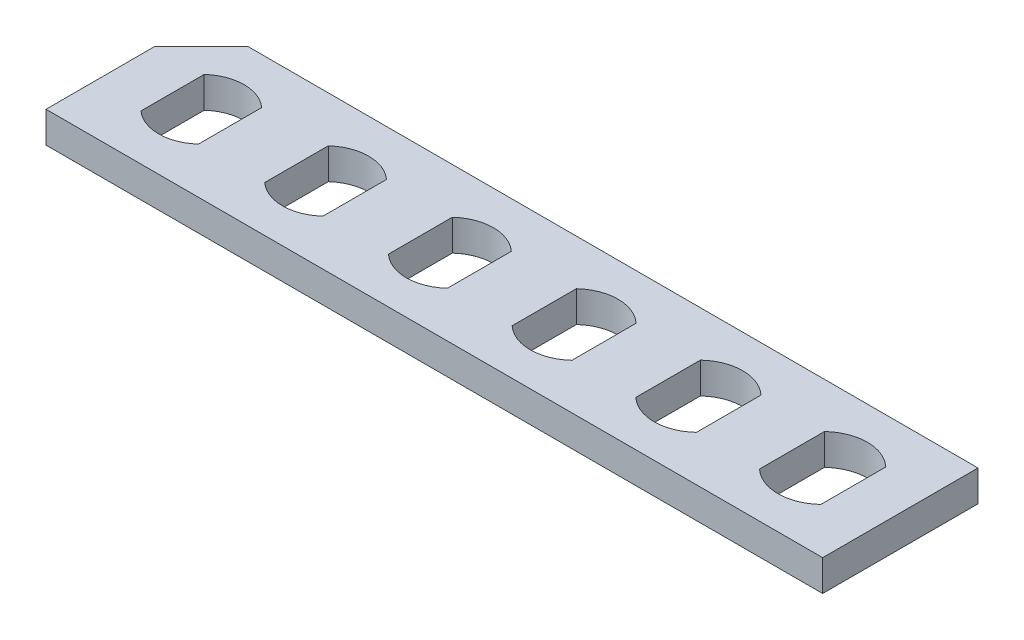
ISO-10303-21;
HEADER;
FILE_DESCRIPTION(('STEP AP214'),'2;1');
FILE_NAME('part.step','',(''),(''),'','','');
FILE_SCHEMA(('AUTOMOTIVE_DESIGN { 1 0 10303 214 1 1 1 1 }'));
ENDSEC;
DATA;
#1=APPLICATION_CONTEXT('core data for automotive mechanical design processes');
#2=APPLICATION_PROTOCOL_DEFINITION('international standard','automotive_design',2000,#1);
#3=PRODUCT_CONTEXT('',#1,'mechanical');
#4=PRODUCT('Part','Part','',(#3));
#5=PRODUCT_RELATED_PRODUCT_CATEGORY('part','',(#4));
#6=PRODUCT_DEFINITION_FORMATION('','',#4);
#7=PRODUCT_DEFINITION_CONTEXT('part definition',#1,'design');
#8=PRODUCT_DEFINITION('design','',#6,#7);
#9=PRODUCT_DEFINITION_SHAPE('','',#8);
#10=(LENGTH_UNIT() NAMED_UNIT(*) SI_UNIT(.MILLI.,.METRE.));
#11=(NAMED_UNIT(*) PLANE_ANGLE_UNIT() SI_UNIT($,.RADIAN.));
#12=(NAMED_UNIT(*) SI_UNIT($,.STERADIAN.) SOLID_ANGLE_UNIT());
#13=UNCERTAINTY_MEASURE_WITH_UNIT(LENGTH_MEASURE(1.E-05),#10,'distance_accuracy_value','');
#14=(GEOMETRIC_REPRESENTATION_CONTEXT(3) GLOBAL_UNCERTAINTY_ASSIGNED_CONTEXT((#13)) GLOBAL_UNIT_ASSIGNED_CONTEXT((#10,
#11,#12)) REPRESENTATION_CONTEXT('',''));
#15=CARTESIAN_POINT('',(0.,0.,0.));
#16=DIRECTION('',(0.,0.,1.));
#17=DIRECTION('',(1.,0.,0.));
#18=AXIS2_PLACEMENT_3D('',#15,#16,#17);
#19=CARTESIAN_POINT('',(0.,2.,0.));
#20=DIRECTION('',(0.,-1.,0.));
#21=DIRECTION('',(0.,0.,-1.));
#22=AXIS2_PLACEMENT_3D('',#19,#20,#21);
#23=PLANE('',#22);
#24=CARTESIAN_POINT('',(37.,2.,-5.));
#25=DIRECTION('',(0.,1.,0.));
#26=DIRECTION('',(0.,0.,1.));
#27=AXIS2_PLACEMENT_3D('',#24,#25,#26);
#28=CIRCLE('',#27,2.85);
#29=CARTESIAN_POINT('',(38.95,2.,-7.07846096908265));
#30=VERTEX_POINT('',#29);
#31=CARTESIAN_POINT('',(35.05,2.,-7.07846096908265));
#32=VERTEX_POINT('',#31);
#33=EDGE_CURVE('E410',#30,#32,#28,.T.);
#34=ORIENTED_EDGE('',*,*,#33,.F.);
#35=DIRECTION('',(0.,0.,-1.));
#36=VECTOR('',#35,1.);
#37=CARTESIAN_POINT('',(38.95,2.,-2.92153903091734));
#38=LINE('',#37,#36);
#39=CARTESIAN_POINT('',(38.95,2.,-2.92153903091734));
#40=VERTEX_POINT('',#39);
#41=EDGE_CURVE('E406',#40,#30,#38,.T.);
#42=ORIENTED_EDGE('',*,*,#41,.F.);
#43=CARTESIAN_POINT('',(37.,2.,-5.));
#44=DIRECTION('',(0.,1.,0.));
#45=DIRECTION('',(0.,0.,1.));
#46=AXIS2_PLACEMENT_3D('',#43,#44,#45);
#47=CIRCLE('',#46,2.85);
#48=CARTESIAN_POINT('',(35.05,2.,-2.92153903091735));
#49=VERTEX_POINT('',#48);
#50=EDGE_CURVE('E422',#49,#40,#47,.T.);
#51=ORIENTED_EDGE('',*,*,#50,.F.);
#52=DIRECTION('',(0.,0.,1.));
#53=VECTOR('',#52,1.);
#54=CARTESIAN_POINT('',(35.05,2.,-7.07846096908265));
#55=LINE('',#54,#53);
#56=EDGE_CURVE('E425',#32,#49,#55,.T.);
#57=ORIENTED_EDGE('',*,*,#56,.F.);
#58=EDGE_LOOP('',(#34,#42,#51,#57));
#59=FACE_BOUND('',#58,.T.);
#60=CARTESIAN_POINT('',(21.,2.,-5.));
#61=DIRECTION('',(0.,1.,0.));
#62=DIRECTION('',(0.,0.,1.));
#63=AXIS2_PLACEMENT_3D('',#60,#61,#62);
#64=CIRCLE('',#63,2.8);
#65=CARTESIAN_POINT('',(22.9,2.,-7.05669638012031));
#66=VERTEX_POINT('',#65);
#67=CARTESIAN_POINT('',(19.1,2.,-7.05669638012031));
#68=VERTEX_POINT('',#67);
#69=EDGE_CURVE('E348',#66,#68,#64,.T.);
#70=ORIENTED_EDGE('',*,*,#69,.F.);
#71=DIRECTION('',(0.,0.,-1.));
#72=VECTOR('',#71,1.);
#73=CARTESIAN_POINT('',(22.9,2.,-2.94330361987968));
#74=LINE('',#73,#72);
#75=CARTESIAN_POINT('',(22.9,2.,-2.94330361987968));
#76=VERTEX_POINT('',#75);
#77=EDGE_CURVE('E344',#76,#66,#74,.T.);
#78=ORIENTED_EDGE('',*,*,#77,.F.);
#79=CARTESIAN_POINT('',(21.,2.,-5.));
#80=DIRECTION('',(0.,1.,0.));
#81=DIRECTION('',(0.,0.,1.));
#82=AXIS2_PLACEMENT_3D('',#79,#80,#81);
#83=CIRCLE('',#82,2.8);
#84=CARTESIAN_POINT('',(19.1,2.,-2.94330361987968));
#85=VERTEX_POINT('',#84);
#86=EDGE_CURVE('E360',#85,#76,#83,.T.);
#87=ORIENTED_EDGE('',*,*,#86,.F.);
#88=DIRECTION('',(0.,0.,1.));
#89=VECTOR('',#88,1.);
#90=CARTESIAN_POINT('',(19.1,2.,-7.05669638012031));
#91=LINE('',#90,#89);
#92=EDGE_CURVE('E363',#68,#85,#91,.T.);
#93=ORIENTED_EDGE('',*,*,#92,.F.);
#94=EDGE_LOOP('',(#70,#78,#87,#93));
#95=FACE_BOUND('',#94,.T.);
#96=CARTESIAN_POINT('',(5.,2.,-5.));
#97=DIRECTION('',(0.,1.,0.));
#98=DIRECTION('',(0.,0.,1.));
#99=AXIS2_PLACEMENT_3D('',#96,#97,#98);
#100=CIRCLE('',#99,2.75);
#101=CARTESIAN_POINT('',(6.85,2.,-7.03469899493758));
#102=VERTEX_POINT('',#101);
#103=CARTESIAN_POINT('',(3.15,2.,-7.03469899493758));
#104=VERTEX_POINT('',#103);
#105=EDGE_CURVE('E286',#102,#104,#100,.T.);
#106=ORIENTED_EDGE('',*,*,#105,.F.);
#107=DIRECTION('',(0.,0.,-1.));
#108=VECTOR('',#107,1.);
#109=CARTESIAN_POINT('',(6.85,2.,-2.96530100506242));
#110=LINE('',#109,#108);
#111=CARTESIAN_POINT('',(6.85,2.,-2.96530100506242));
#112=VERTEX_POINT('',#111);
#113=EDGE_CURVE('E282',#112,#102,#110,.T.);
#114=ORIENTED_EDGE('',*,*,#113,.F.);
#115=CARTESIAN_POINT('',(5.,2.,-5.));
#116=DIRECTION('',(0.,1.,0.));
#117=DIRECTION('',(0.,0.,1.));
#118=AXIS2_PLACEMENT_3D('',#115,#116,#117);
#119=CIRCLE('',#118,2.75);
#120=CARTESIAN_POINT('',(3.15,2.,-2.96530100506242));
#121=VERTEX_POINT('',#120);
#122=EDGE_CURVE('E298',#121,#112,#119,.T.);
#123=ORIENTED_EDGE('',*,*,#122,.F.);
#124=DIRECTION('',(0.,0.,1.));
#125=VECTOR('',#124,1.);
#126=CARTESIAN_POINT('',(3.15,2.,-7.03469899493758));
#127=LINE('',#126,#125);
#128=EDGE_CURVE('E301',#104,#121,#127,.T.);
#129=ORIENTED_EDGE('',*,*,#128,.F.);
#130=EDGE_LOOP('',(#106,#114,#123,#129));
#131=FACE_BOUND('',#130,.T.);
#132=DIRECTION('',(-1.,0.,0.));
#133=VECTOR('',#132,1.);
#134=CARTESIAN_POINT('',(0.,2.,-10.));
#135=LINE('',#134,#133);
#136=CARTESIAN_POINT('',(50.,2.,-10.));
#137=VERTEX_POINT('',#136);
#138=CARTESIAN_POINT('',(3.,2.,-10.));
#139=VERTEX_POINT('',#138);
#140=EDGE_CURVE('E250',#137,#139,#135,.T.);
#141=ORIENTED_EDGE('',*,*,#140,.T.);
#142=DIRECTION('',(0.707106781186548,0.,-0.707106781186548));
#143=VECTOR('',#142,1.);
#144=CARTESIAN_POINT('',(0.,2.,-7.));
#145=LINE('',#144,#143);
#146=CARTESIAN_POINT('',(0.,2.,-7.));
#147=VERTEX_POINT('',#146);
#148=EDGE_CURVE('E47',#147,#139,#145,.T.);
#149=ORIENTED_EDGE('',*,*,#148,.F.);
#150=DIRECTION('',(0.,0.,1.));
#151=VECTOR('',#150,1.);
#152=CARTESIAN_POINT('',(0.,2.,0.));
#153=LINE('',#152,#151);
#154=CARTESIAN_POINT('',(0.,2.,0.));
#155=VERTEX_POINT('',#154);
#156=EDGE_CURVE('E236',#147,#155,#153,.T.);
#157=ORIENTED_EDGE('',*,*,#156,.T.);
#158=DIRECTION('',(1.,0.,0.));
#159=VECTOR('',#158,1.);
#160=CARTESIAN_POINT('',(0.,2.,0.));
#161=LINE('',#160,#159);
#162=CARTESIAN_POINT('',(50.,2.,0.));
#163=VERTEX_POINT('',#162);
#164=EDGE_CURVE('E272',#155,#163,#161,.T.);
#165=ORIENTED_EDGE('',*,*,#164,.T.);
#166=DIRECTION('',(0.,0.,-1.));
#167=VECTOR('',#166,1.);
#168=CARTESIAN_POINT('',(50.,2.,0.));
#169=LINE('',#168,#167);
#170=EDGE_CURVE('E264',#163,#137,#169,.T.);
#171=ORIENTED_EDGE('',*,*,#170,.T.);
#172=EDGE_LOOP('',(#141,#149,#157,#165,#171));
#173=FACE_BOUND('',#172,.T.);
#174=CARTESIAN_POINT('',(13.,2.,-5.));
#175=DIRECTION('',(0.,1.,0.));
#176=DIRECTION('',(0.,0.,1.));
#177=AXIS2_PLACEMENT_3D('',#174,#175,#176);
#178=CIRCLE('',#177,2.775);
#179=CARTESIAN_POINT('',(14.875,2.,-7.04572725454788));
#180=VERTEX_POINT('',#179);
#181=CARTESIAN_POINT('',(11.125,2.,-7.04572725454788));
#182=VERTEX_POINT('',#181);
#183=EDGE_CURVE('E317',#180,#182,#178,.T.);
#184=ORIENTED_EDGE('',*,*,#183,.F.);
#185=DIRECTION('',(0.,0.,-1.));
#186=VECTOR('',#185,1.);
#187=CARTESIAN_POINT('',(14.875,2.,-2.95427274545212));
#188=LINE('',#187,#186);
#189=CARTESIAN_POINT('',(14.875,2.,-2.95427274545212));
#190=VERTEX_POINT('',#189);
#191=EDGE_CURVE('E313',#190,#180,#188,.T.);
#192=ORIENTED_EDGE('',*,*,#191,.F.);
#193=CARTESIAN_POINT('',(13.,2.,-5.));
#194=DIRECTION('',(0.,1.,0.));
#195=DIRECTION('',(0.,0.,1.));
#196=AXIS2_PLACEMENT_3D('',#193,#194,#195);
#197=CIRCLE('',#196,2.775);
#198=CARTESIAN_POINT('',(11.125,2.,-2.95427274545212));
#199=VERTEX_POINT('',#198);
#200=EDGE_CURVE('E329',#199,#190,#197,.T.);
#201=ORIENTED_EDGE('',*,*,#200,.F.);
#202=DIRECTION('',(0.,0.,1.));
#203=VECTOR('',#202,1.);
#204=CARTESIAN_POINT('',(11.125,2.,-7.04572725454788));
#205=LINE('',#204,#203);
#206=EDGE_CURVE('E332',#182,#199,#205,.T.);
#207=ORIENTED_EDGE('',*,*,#206,.F.);
#208=EDGE_LOOP('',(#184,#192,#201,#207));
#209=FACE_BOUND('',#208,.T.);
#210=CARTESIAN_POINT('',(29.,2.,-5.));
#211=DIRECTION('',(0.,1.,0.));
#212=DIRECTION('',(0.,0.,1.));
#213=AXIS2_PLACEMENT_3D('',#210,#211,#212);
#214=CIRCLE('',#213,2.825);
#215=CARTESIAN_POINT('',(30.925,2.,-7.06760731281353));
#216=VERTEX_POINT('',#215);
#217=CARTESIAN_POINT('',(27.075,2.,-7.06760731281353));
#218=VERTEX_POINT('',#217);
#219=EDGE_CURVE('E379',#216,#218,#214,.T.);
#220=ORIENTED_EDGE('',*,*,#219,.F.);
#221=DIRECTION('',(0.,0.,-1.));
#222=VECTOR('',#221,1.);
#223=CARTESIAN_POINT('',(30.925,2.,-2.93239268718647));
#224=LINE('',#223,#222);
#225=CARTESIAN_POINT('',(30.925,2.,-2.93239268718647));
#226=VERTEX_POINT('',#225);
#227=EDGE_CURVE('E375',#226,#216,#224,.T.);
#228=ORIENTED_EDGE('',*,*,#227,.F.);
#229=CARTESIAN_POINT('',(29.,2.,-5.));
#230=DIRECTION('',(0.,1.,0.));
#231=DIRECTION('',(0.,0.,1.));
#232=AXIS2_PLACEMENT_3D('',#229,#230,#231);
#233=CIRCLE('',#232,2.825);
#234=CARTESIAN_POINT('',(27.075,2.,-2.93239268718647));
#235=VERTEX_POINT('',#234);
#236=EDGE_CURVE('E391',#235,#226,#233,.T.);
#237=ORIENTED_EDGE('',*,*,#236,.F.);
#238=DIRECTION('',(0.,0.,1.));
#239=VECTOR('',#238,1.);
#240=CARTESIAN_POINT('',(27.075,2.,-7.06760731281353));
#241=LINE('',#240,#239);
#242=EDGE_CURVE('E394',#218,#235,#241,.T.);
#243=ORIENTED_EDGE('',*,*,#242,.F.);
#244=EDGE_LOOP('',(#220,#228,#237,#243));
#245=FACE_BOUND('',#244,.T.);
#246=CARTESIAN_POINT('',(45.,2.,-5.));
#247=DIRECTION('',(0.,1.,0.));
#248=DIRECTION('',(0.,0.,1.));
#249=AXIS2_PLACEMENT_3D('',#246,#247,#248);
#250=CIRCLE('',#249,2.875);
#251=CARTESIAN_POINT('',(46.975,2.,-7.08925824157762));
#252=VERTEX_POINT('',#251);
#253=CARTESIAN_POINT('',(43.025,2.,-7.08925824157762));
#254=VERTEX_POINT('',#253);
#255=EDGE_CURVE('E440',#252,#254,#250,.T.);
#256=ORIENTED_EDGE('',*,*,#255,.F.);
#257=DIRECTION('',(0.,0.,-1.));
#258=VECTOR('',#257,1.);
#259=CARTESIAN_POINT('',(46.975,2.,-2.91074175842239));
#260=LINE('',#259,#258);
#261=CARTESIAN_POINT('',(46.975,2.,-2.91074175842239));
#262=VERTEX_POINT('',#261);
#263=EDGE_CURVE('E436',#262,#252,#260,.T.);
#264=ORIENTED_EDGE('',*,*,#263,.F.);
#265=CARTESIAN_POINT('',(45.,2.,-5.));
#266=DIRECTION('',(0.,1.,0.));
#267=DIRECTION('',(0.,0.,1.));
#268=AXIS2_PLACEMENT_3D('',#265,#266,#267);
#269=CIRCLE('',#268,2.875);
#270=CARTESIAN_POINT('',(43.025,2.,-2.91074175842239));
#271=VERTEX_POINT('',#270);
#272=EDGE_CURVE('E451',#271,#262,#269,.T.);
#273=ORIENTED_EDGE('',*,*,#272,.F.);
#274=DIRECTION('',(0.,0.,1.));
#275=VECTOR('',#274,1.);
#276=CARTESIAN_POINT('',(43.025,2.,-7.08925824157762));
#277=LINE('',#276,#275);
#278=EDGE_CURVE('E453',#254,#271,#277,.T.);
#279=ORIENTED_EDGE('',*,*,#278,.F.);
#280=EDGE_LOOP('',(#256,#264,#273,#279));
#281=FACE_BOUND('',#280,.T.);
#282=ADVANCED_FACE('F32',(#59,#95,#131,#173,#209,#245,#281),#23,.F.);
#283=CARTESIAN_POINT('',(0.,0.,0.));
#284=DIRECTION('',(0.,-1.,0.));
#285=DIRECTION('',(0.,0.,-1.));
#286=AXIS2_PLACEMENT_3D('',#283,#284,#285);
#287=PLANE('',#286);
#288=DIRECTION('',(0.707106781186548,0.,-0.707106781186548));
#289=VECTOR('',#288,1.);
#290=CARTESIAN_POINT('',(0.,0.,-7.));
#291=LINE('',#290,#289);
#292=CARTESIAN_POINT('',(0.,0.,-7.));
#293=VERTEX_POINT('',#292);
#294=CARTESIAN_POINT('',(3.,0.,-10.));
#295=VERTEX_POINT('',#294);
#296=EDGE_CURVE('E221',#293,#295,#291,.T.);
#297=ORIENTED_EDGE('',*,*,#296,.T.);
#298=DIRECTION('',(-1.,0.,0.));
#299=VECTOR('',#298,1.);
#300=CARTESIAN_POINT('',(0.,0.,-10.));
#301=LINE('',#300,#299);
#302=CARTESIAN_POINT('',(50.,0.,-10.));
#303=VERTEX_POINT('',#302);
#304=EDGE_CURVE('E254',#303,#295,#301,.T.);
#305=ORIENTED_EDGE('',*,*,#304,.F.);
#306=DIRECTION('',(0.,0.,-1.));
#307=VECTOR('',#306,1.);
#308=CARTESIAN_POINT('',(50.,0.,0.));
#309=LINE('',#308,#307);
#310=CARTESIAN_POINT('',(50.,0.,0.));
#311=VERTEX_POINT('',#310);
#312=EDGE_CURVE('E244',#311,#303,#309,.T.);
#313=ORIENTED_EDGE('',*,*,#312,.F.);
#314=DIRECTION('',(1.,0.,0.));
#315=VECTOR('',#314,1.);
#316=CARTESIAN_POINT('',(0.,0.,0.));
#317=LINE('',#316,#315);
#318=CARTESIAN_POINT('',(0.,0.,0.));
#319=VERTEX_POINT('',#318);
#320=EDGE_CURVE('E241',#319,#311,#317,.T.);
#321=ORIENTED_EDGE('',*,*,#320,.F.);
#322=DIRECTION('',(0.,0.,1.));
#323=VECTOR('',#322,1.);
#324=CARTESIAN_POINT('',(0.,0.,0.));
#325=LINE('',#324,#323);
#326=EDGE_CURVE('E234',#293,#319,#325,.T.);
#327=ORIENTED_EDGE('',*,*,#326,.F.);
#328=EDGE_LOOP('',(#297,#305,#313,#321,#327));
#329=FACE_BOUND('',#328,.T.);
#330=DIRECTION('',(0.,0.,-1.));
#331=VECTOR('',#330,1.);
#332=CARTESIAN_POINT('',(6.85,0.,-2.96530100506242));
#333=LINE('',#332,#331);
#334=CARTESIAN_POINT('',(6.85,0.,-2.96530100506242));
#335=VERTEX_POINT('',#334);
#336=CARTESIAN_POINT('',(6.85,0.,-7.03469899493758));
#337=VERTEX_POINT('',#336);
#338=EDGE_CURVE('E283',#335,#337,#333,.T.);
#339=ORIENTED_EDGE('',*,*,#338,.T.);
#340=CARTESIAN_POINT('',(5.,0.,-5.));
#341=DIRECTION('',(0.,1.,0.));
#342=DIRECTION('',(0.,0.,1.));
#343=AXIS2_PLACEMENT_3D('',#340,#341,#342);
#344=CIRCLE('',#343,2.75);
#345=CARTESIAN_POINT('',(3.15,0.,-7.03469899493758));
#346=VERTEX_POINT('',#345);
#347=EDGE_CURVE('E293',#337,#346,#344,.T.);
#348=ORIENTED_EDGE('',*,*,#347,.T.);
#349=DIRECTION('',(0.,0.,1.));
#350=VECTOR('',#349,1.);
#351=CARTESIAN_POINT('',(3.15,0.,-7.03469899493758));
#352=LINE('',#351,#350);
#353=CARTESIAN_POINT('',(3.15,0.,-2.96530100506242));
#354=VERTEX_POINT('',#353);
#355=EDGE_CURVE('E290',#346,#354,#352,.T.);
#356=ORIENTED_EDGE('',*,*,#355,.T.);
#357=CARTESIAN_POINT('',(5.,0.,-5.));
#358=DIRECTION('',(0.,1.,0.));
#359=DIRECTION('',(0.,0.,1.));
#360=AXIS2_PLACEMENT_3D('',#357,#358,#359);
#361=CIRCLE('',#360,2.75);
#362=EDGE_CURVE('E287',#354,#335,#361,.T.);
#363=ORIENTED_EDGE('',*,*,#362,.T.);
#364=EDGE_LOOP('',(#339,#348,#356,#363));
#365=FACE_BOUND('',#364,.T.);
#366=DIRECTION('',(0.,0.,-1.));
#367=VECTOR('',#366,1.);
#368=CARTESIAN_POINT('',(14.875,0.,-2.95427274545212));
#369=LINE('',#368,#367);
#370=CARTESIAN_POINT('',(14.875,0.,-2.95427274545212));
#371=VERTEX_POINT('',#370);
#372=CARTESIAN_POINT('',(14.875,0.,-7.04572725454788));
#373=VERTEX_POINT('',#372);
#374=EDGE_CURVE('E314',#371,#373,#369,.T.);
#375=ORIENTED_EDGE('',*,*,#374,.T.);
#376=CARTESIAN_POINT('',(13.,0.,-5.));
#377=DIRECTION('',(0.,1.,0.));
#378=DIRECTION('',(0.,0.,1.));
#379=AXIS2_PLACEMENT_3D('',#376,#377,#378);
#380=CIRCLE('',#379,2.775);
#381=CARTESIAN_POINT('',(11.125,0.,-7.04572725454788));
#382=VERTEX_POINT('',#381);
#383=EDGE_CURVE('E324',#373,#382,#380,.T.);
#384=ORIENTED_EDGE('',*,*,#383,.T.);
#385=DIRECTION('',(0.,0.,1.));
#386=VECTOR('',#385,1.);
#387=CARTESIAN_POINT('',(11.125,0.,-7.04572725454788));
#388=LINE('',#387,#386);
#389=CARTESIAN_POINT('',(11.125,0.,-2.95427274545212));
#390=VERTEX_POINT('',#389);
#391=EDGE_CURVE('E321',#382,#390,#388,.T.);
#392=ORIENTED_EDGE('',*,*,#391,.T.);
#393=CARTESIAN_POINT('',(13.,0.,-5.));
#394=DIRECTION('',(0.,1.,0.));
#395=DIRECTION('',(0.,0.,1.));
#396=AXIS2_PLACEMENT_3D('',#393,#394,#395);
#397=CIRCLE('',#396,2.775);
#398=EDGE_CURVE('E318',#390,#371,#397,.T.);
#399=ORIENTED_EDGE('',*,*,#398,.T.);
#400=EDGE_LOOP('',(#375,#384,#392,#399));
#401=FACE_BOUND('',#400,.T.);
#402=DIRECTION('',(0.,0.,-1.));
#403=VECTOR('',#402,1.);
#404=CARTESIAN_POINT('',(22.9,0.,-2.94330361987968));
#405=LINE('',#404,#403);
#406=CARTESIAN_POINT('',(22.9,0.,-2.94330361987968));
#407=VERTEX_POINT('',#406);
#408=CARTESIAN_POINT('',(22.9,0.,-7.05669638012031));
#409=VERTEX_POINT('',#408);
#410=EDGE_CURVE('E345',#407,#409,#405,.T.);
#411=ORIENTED_EDGE('',*,*,#410,.T.);
#412=CARTESIAN_POINT('',(21.,0.,-5.));
#413=DIRECTION('',(0.,1.,0.));
#414=DIRECTION('',(0.,0.,1.));
#415=AXIS2_PLACEMENT_3D('',#412,#413,#414);
#416=CIRCLE('',#415,2.8);
#417=CARTESIAN_POINT('',(19.1,0.,-7.05669638012031));
#418=VERTEX_POINT('',#417);
#419=EDGE_CURVE('E355',#409,#418,#416,.T.);
#420=ORIENTED_EDGE('',*,*,#419,.T.);
#421=DIRECTION('',(0.,0.,1.));
#422=VECTOR('',#421,1.);
#423=CARTESIAN_POINT('',(19.1,0.,-7.05669638012031));
#424=LINE('',#423,#422);
#425=CARTESIAN_POINT('',(19.1,0.,-2.94330361987968));
#426=VERTEX_POINT('',#425);
#427=EDGE_CURVE('E352',#418,#426,#424,.T.);
#428=ORIENTED_EDGE('',*,*,#427,.T.);
#429=CARTESIAN_POINT('',(21.,0.,-5.));
#430=DIRECTION('',(0.,1.,0.));
#431=DIRECTION('',(0.,0.,1.));
#432=AXIS2_PLACEMENT_3D('',#429,#430,#431);
#433=CIRCLE('',#432,2.8);
#434=EDGE_CURVE('E349',#426,#407,#433,.T.);
#435=ORIENTED_EDGE('',*,*,#434,.T.);
#436=EDGE_LOOP('',(#411,#420,#428,#435));
#437=FACE_BOUND('',#436,.T.);
#438=DIRECTION('',(0.,0.,-1.));
#439=VECTOR('',#438,1.);
#440=CARTESIAN_POINT('',(30.925,0.,-2.93239268718647));
#441=LINE('',#440,#439);
#442=CARTESIAN_POINT('',(30.925,0.,-2.93239268718647));
#443=VERTEX_POINT('',#442);
#444=CARTESIAN_POINT('',(30.925,0.,-7.06760731281353));
#445=VERTEX_POINT('',#444);
#446=EDGE_CURVE('E376',#443,#445,#441,.T.);
#447=ORIENTED_EDGE('',*,*,#446,.T.);
#448=CARTESIAN_POINT('',(29.,0.,-5.));
#449=DIRECTION('',(0.,1.,0.));
#450=DIRECTION('',(0.,0.,1.));
#451=AXIS2_PLACEMENT_3D('',#448,#449,#450);
#452=CIRCLE('',#451,2.825);
#453=CARTESIAN_POINT('',(27.075,0.,-7.06760731281353));
#454=VERTEX_POINT('',#453);
#455=EDGE_CURVE('E386',#445,#454,#452,.T.);
#456=ORIENTED_EDGE('',*,*,#455,.T.);
#457=DIRECTION('',(0.,0.,1.));
#458=VECTOR('',#457,1.);
#459=CARTESIAN_POINT('',(27.075,0.,-7.06760731281353));
#460=LINE('',#459,#458);
#461=CARTESIAN_POINT('',(27.075,0.,-2.93239268718647));
#462=VERTEX_POINT('',#461);
#463=EDGE_CURVE('E383',#454,#462,#460,.T.);
#464=ORIENTED_EDGE('',*,*,#463,.T.);
#465=CARTESIAN_POINT('',(29.,0.,-5.));
#466=DIRECTION('',(0.,1.,0.));
#467=DIRECTION('',(0.,0.,1.));
#468=AXIS2_PLACEMENT_3D('',#465,#466,#467);
#469=CIRCLE('',#468,2.825);
#470=EDGE_CURVE('E380',#462,#443,#469,.T.);
#471=ORIENTED_EDGE('',*,*,#470,.T.);
#472=EDGE_LOOP('',(#447,#456,#464,#471));
#473=FACE_BOUND('',#472,.T.);
#474=DIRECTION('',(0.,0.,-1.));
#475=VECTOR('',#474,1.);
#476=CARTESIAN_POINT('',(38.95,0.,-2.92153903091734));
#477=LINE('',#476,#475);
#478=CARTESIAN_POINT('',(38.95,0.,-2.92153903091734));
#479=VERTEX_POINT('',#478);
#480=CARTESIAN_POINT('',(38.95,0.,-7.07846096908265));
#481=VERTEX_POINT('',#480);
#482=EDGE_CURVE('E407',#479,#481,#477,.T.);
#483=ORIENTED_EDGE('',*,*,#482,.T.);
#484=CARTESIAN_POINT('',(37.,0.,-5.));
#485=DIRECTION('',(0.,1.,0.));
#486=DIRECTION('',(0.,0.,1.));
#487=AXIS2_PLACEMENT_3D('',#484,#485,#486);
#488=CIRCLE('',#487,2.85);
#489=CARTESIAN_POINT('',(35.05,0.,-7.07846096908265));
#490=VERTEX_POINT('',#489);
#491=EDGE_CURVE('E417',#481,#490,#488,.T.);
#492=ORIENTED_EDGE('',*,*,#491,.T.);
#493=DIRECTION('',(0.,0.,1.));
#494=VECTOR('',#493,1.);
#495=CARTESIAN_POINT('',(35.05,0.,-7.07846096908265));
#496=LINE('',#495,#494);
#497=CARTESIAN_POINT('',(35.05,0.,-2.92153903091735));
#498=VERTEX_POINT('',#497);
#499=EDGE_CURVE('E414',#490,#498,#496,.T.);
#500=ORIENTED_EDGE('',*,*,#499,.T.);
#501=CARTESIAN_POINT('',(37.,0.,-5.));
#502=DIRECTION('',(0.,1.,0.));
#503=DIRECTION('',(0.,0.,1.));
#504=AXIS2_PLACEMENT_3D('',#501,#502,#503);
#505=CIRCLE('',#504,2.85);
#506=EDGE_CURVE('E411',#498,#479,#505,.T.);
#507=ORIENTED_EDGE('',*,*,#506,.T.);
#508=EDGE_LOOP('',(#483,#492,#500,#507));
#509=FACE_BOUND('',#508,.T.);
#510=DIRECTION('',(0.,0.,-1.));
#511=VECTOR('',#510,1.);
#512=CARTESIAN_POINT('',(46.975,0.,-2.91074175842239));
#513=LINE('',#512,#511);
#514=CARTESIAN_POINT('',(46.975,0.,-2.91074175842239));
#515=VERTEX_POINT('',#514);
#516=CARTESIAN_POINT('',(46.975,0.,-7.08925824157762));
#517=VERTEX_POINT('',#516);
#518=EDGE_CURVE('E437',#515,#517,#513,.T.);
#519=ORIENTED_EDGE('',*,*,#518,.T.);
#520=CARTESIAN_POINT('',(45.,0.,-5.));
#521=DIRECTION('',(0.,1.,0.));
#522=DIRECTION('',(0.,0.,1.));
#523=AXIS2_PLACEMENT_3D('',#520,#521,#522);
#524=CIRCLE('',#523,2.875);
#525=CARTESIAN_POINT('',(43.025,0.,-7.08925824157762));
#526=VERTEX_POINT('',#525);
#527=EDGE_CURVE('E447',#517,#526,#524,.T.);
#528=ORIENTED_EDGE('',*,*,#527,.T.);
#529=DIRECTION('',(0.,0.,1.));
#530=VECTOR('',#529,1.);
#531=CARTESIAN_POINT('',(43.025,0.,-7.08925824157762));
#532=LINE('',#531,#530);
#533=CARTESIAN_POINT('',(43.025,0.,-2.91074175842239));
#534=VERTEX_POINT('',#533);
#535=EDGE_CURVE('E444',#526,#534,#532,.T.);
#536=ORIENTED_EDGE('',*,*,#535,.T.);
#537=CARTESIAN_POINT('',(45.,0.,-5.));
#538=DIRECTION('',(0.,1.,0.));
#539=DIRECTION('',(0.,0.,1.));
#540=AXIS2_PLACEMENT_3D('',#537,#538,#539);
#541=CIRCLE('',#540,2.875);
#542=EDGE_CURVE('E441',#534,#515,#541,.T.);
#543=ORIENTED_EDGE('',*,*,#542,.T.);
#544=EDGE_LOOP('',(#519,#528,#536,#543));
#545=FACE_BOUND('',#544,.T.);
#546=ADVANCED_FACE('F238',(#329,#365,#401,#437,#473,#509,#545),#287,.T.);
#547=CARTESIAN_POINT('',(0.,2.,0.));
#548=DIRECTION('',(1.,0.,0.));
#549=DIRECTION('',(0.,0.,-1.));
#550=AXIS2_PLACEMENT_3D('',#547,#548,#549);
#551=PLANE('',#550);
#552=ORIENTED_EDGE('',*,*,#156,.F.);
#553=DIRECTION('',(0.,1.,0.));
#554=VECTOR('',#553,1.);
#555=CARTESIAN_POINT('',(0.,0.,-7.));
#556=LINE('',#555,#554);
#557=EDGE_CURVE('E224',#293,#147,#556,.T.);
#558=ORIENTED_EDGE('',*,*,#557,.F.);
#559=ORIENTED_EDGE('',*,*,#326,.T.);
#560=DIRECTION('',(0.,-1.,0.));
#561=VECTOR('',#560,1.);
#562=CARTESIAN_POINT('',(0.,2.,0.));
#563=LINE('',#562,#561);
#564=EDGE_CURVE('E11',#155,#319,#563,.T.);
#565=ORIENTED_EDGE('',*,*,#564,.F.);
#566=EDGE_LOOP('',(#552,#558,#559,#565));
#567=FACE_BOUND('',#566,.T.);
#568=ADVANCED_FACE('F34',(#567),#551,.F.);
#569=CARTESIAN_POINT('',(0.,2.,0.));
#570=DIRECTION('',(0.,0.,-1.));
#571=DIRECTION('',(-1.,0.,0.));
#572=AXIS2_PLACEMENT_3D('',#569,#570,#571);
#573=PLANE('',#572);
#574=ORIENTED_EDGE('',*,*,#320,.T.);
#575=DIRECTION('',(0.,-1.,0.));
#576=VECTOR('',#575,1.);
#577=CARTESIAN_POINT('',(50.,2.,0.));
#578=LINE('',#577,#576);
#579=EDGE_CURVE('E40',#163,#311,#578,.T.);
#580=ORIENTED_EDGE('',*,*,#579,.F.);
#581=ORIENTED_EDGE('',*,*,#164,.F.);
#582=ORIENTED_EDGE('',*,*,#564,.T.);
#583=EDGE_LOOP('',(#574,#580,#581,#582));
#584=FACE_BOUND('',#583,.T.);
#585=ADVANCED_FACE('F498',(#584),#573,.F.);
#586=CARTESIAN_POINT('',(50.,2.,0.));
#587=DIRECTION('',(-1.,0.,0.));
#588=DIRECTION('',(0.,0.,1.));
#589=AXIS2_PLACEMENT_3D('',#586,#587,#588);
#590=PLANE('',#589);
#591=ORIENTED_EDGE('',*,*,#312,.T.);
#592=DIRECTION('',(0.,-1.,0.));
#593=VECTOR('',#592,1.);
#594=CARTESIAN_POINT('',(50.,2.,-10.));
#595=LINE('',#594,#593);
#596=EDGE_CURVE('E256',#137,#303,#595,.T.);
#597=ORIENTED_EDGE('',*,*,#596,.F.);
#598=ORIENTED_EDGE('',*,*,#170,.F.);
#599=ORIENTED_EDGE('',*,*,#579,.T.);
#600=EDGE_LOOP('',(#591,#597,#598,#599));
#601=FACE_BOUND('',#600,.T.);
#602=ADVANCED_FACE('F262',(#601),#590,.F.);
#603=CARTESIAN_POINT('',(0.,2.,-10.));
#604=DIRECTION('',(0.,0.,1.));
#605=DIRECTION('',(1.,0.,0.));
#606=AXIS2_PLACEMENT_3D('',#603,#604,#605);
#607=PLANE('',#606);
#608=ORIENTED_EDGE('',*,*,#304,.T.);
#609=DIRECTION('',(0.,1.,0.));
#610=VECTOR('',#609,1.);
#611=CARTESIAN_POINT('',(3.,0.,-10.));
#612=LINE('',#611,#610);
#613=EDGE_CURVE('E225',#295,#139,#612,.T.);
#614=ORIENTED_EDGE('',*,*,#613,.T.);
#615=ORIENTED_EDGE('',*,*,#140,.F.);
#616=ORIENTED_EDGE('',*,*,#596,.T.);
#617=EDGE_LOOP('',(#608,#614,#615,#616));
#618=FACE_BOUND('',#617,.T.);
#619=ADVANCED_FACE('F268',(#618),#607,.F.);
#620=CARTESIAN_POINT('',(5.,2.,-5.));
#621=DIRECTION('',(0.,-1.,0.));
#622=DIRECTION('',(0.,0.,-1.));
#623=AXIS2_PLACEMENT_3D('',#620,#621,#622);
#624=CYLINDRICAL_SURFACE('',#623,2.75);
#625=ORIENTED_EDGE('',*,*,#347,.F.);
#626=DIRECTION('',(0.,-1.,0.));
#627=VECTOR('',#626,1.);
#628=CARTESIAN_POINT('',(6.85,2.,-7.03469899493758));
#629=LINE('',#628,#627);
#630=EDGE_CURVE('E279',#102,#337,#629,.T.);
#631=ORIENTED_EDGE('',*,*,#630,.F.);
#632=ORIENTED_EDGE('',*,*,#105,.T.);
#633=DIRECTION('',(0.,-1.,0.));
#634=VECTOR('',#633,1.);
#635=CARTESIAN_POINT('',(3.15,2.,-7.03469899493758));
#636=LINE('',#635,#634);
#637=EDGE_CURVE('E242',#104,#346,#636,.T.);
#638=ORIENTED_EDGE('',*,*,#637,.T.);
#639=EDGE_LOOP('',(#625,#631,#632,#638));
#640=FACE_BOUND('',#639,.T.);
#641=ADVANCED_FACE('F492',(#640),#624,.F.);
#642=CARTESIAN_POINT('',(3.15,2.,-7.03469899493758));
#643=DIRECTION('',(1.,0.,0.));
#644=DIRECTION('',(0.,0.,-1.));
#645=AXIS2_PLACEMENT_3D('',#642,#643,#644);
#646=PLANE('',#645);
#647=ORIENTED_EDGE('',*,*,#355,.F.);
#648=ORIENTED_EDGE('',*,*,#637,.F.);
#649=ORIENTED_EDGE('',*,*,#128,.T.);
#650=DIRECTION('',(0.,-1.,0.));
#651=VECTOR('',#650,1.);
#652=CARTESIAN_POINT('',(3.15,2.,-2.96530100506242));
#653=LINE('',#652,#651);
#654=EDGE_CURVE('E247',#121,#354,#653,.T.);
#655=ORIENTED_EDGE('',*,*,#654,.T.);
#656=EDGE_LOOP('',(#647,#648,#649,#655));
#657=FACE_BOUND('',#656,.T.);
#658=ADVANCED_FACE('F578',(#657),#646,.T.);
#659=CARTESIAN_POINT('',(5.,2.,-5.));
#660=DIRECTION('',(0.,-1.,0.));
#661=DIRECTION('',(0.,0.,-1.));
#662=AXIS2_PLACEMENT_3D('',#659,#660,#661);
#663=CYLINDRICAL_SURFACE('',#662,2.75);
#664=ORIENTED_EDGE('',*,*,#362,.F.);
#665=ORIENTED_EDGE('',*,*,#654,.F.);
#666=ORIENTED_EDGE('',*,*,#122,.T.);
#667=DIRECTION('',(0.,-1.,0.));
#668=VECTOR('',#667,1.);
#669=CARTESIAN_POINT('',(6.85,2.,-2.96530100506242));
#670=LINE('',#669,#668);
#671=EDGE_CURVE('E277',#112,#335,#670,.T.);
#672=ORIENTED_EDGE('',*,*,#671,.T.);
#673=EDGE_LOOP('',(#664,#665,#666,#672));
#674=FACE_BOUND('',#673,.T.);
#675=ADVANCED_FACE('F575',(#674),#663,.F.);
#676=CARTESIAN_POINT('',(6.85,2.,-2.96530100506242));
#677=DIRECTION('',(-1.,0.,0.));
#678=DIRECTION('',(0.,0.,1.));
#679=AXIS2_PLACEMENT_3D('',#676,#677,#678);
#680=PLANE('',#679);
#681=ORIENTED_EDGE('',*,*,#338,.F.);
#682=ORIENTED_EDGE('',*,*,#671,.F.);
#683=ORIENTED_EDGE('',*,*,#113,.T.);
#684=ORIENTED_EDGE('',*,*,#630,.T.);
#685=EDGE_LOOP('',(#681,#682,#683,#684));
#686=FACE_BOUND('',#685,.T.);
#687=ADVANCED_FACE('F571',(#686),#680,.T.);
#688=CARTESIAN_POINT('',(13.,2.,-5.));
#689=DIRECTION('',(0.,-1.,0.));
#690=DIRECTION('',(0.,0.,-1.));
#691=AXIS2_PLACEMENT_3D('',#688,#689,#690);
#692=CYLINDRICAL_SURFACE('',#691,2.775);
#693=ORIENTED_EDGE('',*,*,#383,.F.);
#694=DIRECTION('',(0.,-1.,0.));
#695=VECTOR('',#694,1.);
#696=CARTESIAN_POINT('',(14.875,2.,-7.04572725454788));
#697=LINE('',#696,#695);
#698=EDGE_CURVE('E310',#180,#373,#697,.T.);
#699=ORIENTED_EDGE('',*,*,#698,.F.);
#700=ORIENTED_EDGE('',*,*,#183,.T.);
#701=DIRECTION('',(0.,-1.,0.));
#702=VECTOR('',#701,1.);
#703=CARTESIAN_POINT('',(11.125,2.,-7.04572725454788));
#704=LINE('',#703,#702);
#705=EDGE_CURVE('E296',#182,#382,#704,.T.);
#706=ORIENTED_EDGE('',*,*,#705,.T.);
#707=EDGE_LOOP('',(#693,#699,#700,#706));
#708=FACE_BOUND('',#707,.T.);
#709=ADVANCED_FACE('F567',(#708),#692,.F.);
#710=CARTESIAN_POINT('',(11.125,2.,-7.04572725454788));
#711=DIRECTION('',(1.,0.,0.));
#712=DIRECTION('',(0.,0.,-1.));
#713=AXIS2_PLACEMENT_3D('',#710,#711,#712);
#714=PLANE('',#713);
#715=ORIENTED_EDGE('',*,*,#391,.F.);
#716=ORIENTED_EDGE('',*,*,#705,.F.);
#717=ORIENTED_EDGE('',*,*,#206,.T.);
#718=DIRECTION('',(0.,-1.,0.));
#719=VECTOR('',#718,1.);
#720=CARTESIAN_POINT('',(11.125,2.,-2.95427274545212));
#721=LINE('',#720,#719);
#722=EDGE_CURVE('E306',#199,#390,#721,.T.);
#723=ORIENTED_EDGE('',*,*,#722,.T.);
#724=EDGE_LOOP('',(#715,#716,#717,#723));
#725=FACE_BOUND('',#724,.T.);
#726=ADVANCED_FACE('F563',(#725),#714,.T.);
#727=CARTESIAN_POINT('',(13.,2.,-5.));
#728=DIRECTION('',(0.,-1.,0.));
#729=DIRECTION('',(0.,0.,-1.));
#730=AXIS2_PLACEMENT_3D('',#727,#728,#729);
#731=CYLINDRICAL_SURFACE('',#730,2.775);
#732=ORIENTED_EDGE('',*,*,#398,.F.);
#733=ORIENTED_EDGE('',*,*,#722,.F.);
#734=ORIENTED_EDGE('',*,*,#200,.T.);
#735=DIRECTION('',(0.,-1.,0.));
#736=VECTOR('',#735,1.);
#737=CARTESIAN_POINT('',(14.875,2.,-2.95427274545212));
#738=LINE('',#737,#736);
#739=EDGE_CURVE('E308',#190,#371,#738,.T.);
#740=ORIENTED_EDGE('',*,*,#739,.T.);
#741=EDGE_LOOP('',(#732,#733,#734,#740));
#742=FACE_BOUND('',#741,.T.);
#743=ADVANCED_FACE('F559',(#742),#731,.F.);
#744=CARTESIAN_POINT('',(14.875,2.,-2.95427274545212));
#745=DIRECTION('',(-1.,0.,0.));
#746=DIRECTION('',(0.,0.,1.));
#747=AXIS2_PLACEMENT_3D('',#744,#745,#746);
#748=PLANE('',#747);
#749=ORIENTED_EDGE('',*,*,#374,.F.);
#750=ORIENTED_EDGE('',*,*,#739,.F.);
#751=ORIENTED_EDGE('',*,*,#191,.T.);
#752=ORIENTED_EDGE('',*,*,#698,.T.);
#753=EDGE_LOOP('',(#749,#750,#751,#752));
#754=FACE_BOUND('',#753,.T.);
#755=ADVANCED_FACE('F555',(#754),#748,.T.);
#756=CARTESIAN_POINT('',(21.,2.,-5.));
#757=DIRECTION('',(0.,-1.,0.));
#758=DIRECTION('',(0.,0.,-1.));
#759=AXIS2_PLACEMENT_3D('',#756,#757,#758);
#760=CYLINDRICAL_SURFACE('',#759,2.8);
#761=ORIENTED_EDGE('',*,*,#419,.F.);
#762=DIRECTION('',(0.,-1.,0.));
#763=VECTOR('',#762,1.);
#764=CARTESIAN_POINT('',(22.9,2.,-7.05669638012031));
#765=LINE('',#764,#763);
#766=EDGE_CURVE('E341',#66,#409,#765,.T.);
#767=ORIENTED_EDGE('',*,*,#766,.F.);
#768=ORIENTED_EDGE('',*,*,#69,.T.);
#769=DIRECTION('',(0.,-1.,0.));
#770=VECTOR('',#769,1.);
#771=CARTESIAN_POINT('',(19.1,2.,-7.05669638012031));
#772=LINE('',#771,#770);
#773=EDGE_CURVE('E327',#68,#418,#772,.T.);
#774=ORIENTED_EDGE('',*,*,#773,.T.);
#775=EDGE_LOOP('',(#761,#767,#768,#774));
#776=FACE_BOUND('',#775,.T.);
#777=ADVANCED_FACE('F551',(#776),#760,.F.);
#778=CARTESIAN_POINT('',(19.1,2.,-7.05669638012031));
#779=DIRECTION('',(1.,0.,0.));
#780=DIRECTION('',(0.,0.,-1.));
#781=AXIS2_PLACEMENT_3D('',#778,#779,#780);
#782=PLANE('',#781);
#783=ORIENTED_EDGE('',*,*,#427,.F.);
#784=ORIENTED_EDGE('',*,*,#773,.F.);
#785=ORIENTED_EDGE('',*,*,#92,.T.);
#786=DIRECTION('',(0.,-1.,0.));
#787=VECTOR('',#786,1.);
#788=CARTESIAN_POINT('',(19.1,2.,-2.94330361987968));
#789=LINE('',#788,#787);
#790=EDGE_CURVE('E337',#85,#426,#789,.T.);
#791=ORIENTED_EDGE('',*,*,#790,.T.);
#792=EDGE_LOOP('',(#783,#784,#785,#791));
#793=FACE_BOUND('',#792,.T.);
#794=ADVANCED_FACE('F547',(#793),#782,.T.);
#795=CARTESIAN_POINT('',(21.,2.,-5.));
#796=DIRECTION('',(0.,-1.,0.));
#797=DIRECTION('',(0.,0.,-1.));
#798=AXIS2_PLACEMENT_3D('',#795,#796,#797);
#799=CYLINDRICAL_SURFACE('',#798,2.8);
#800=ORIENTED_EDGE('',*,*,#434,.F.);
#801=ORIENTED_EDGE('',*,*,#790,.F.);
#802=ORIENTED_EDGE('',*,*,#86,.T.);
#803=DIRECTION('',(0.,-1.,0.));
#804=VECTOR('',#803,1.);
#805=CARTESIAN_POINT('',(22.9,2.,-2.94330361987968));
#806=LINE('',#805,#804);
#807=EDGE_CURVE('E339',#76,#407,#806,.T.);
#808=ORIENTED_EDGE('',*,*,#807,.T.);
#809=EDGE_LOOP('',(#800,#801,#802,#808));
#810=FACE_BOUND('',#809,.T.);
#811=ADVANCED_FACE('F543',(#810),#799,.F.);
#812=CARTESIAN_POINT('',(22.9,2.,-2.94330361987968));
#813=DIRECTION('',(-1.,0.,0.));
#814=DIRECTION('',(0.,0.,1.));
#815=AXIS2_PLACEMENT_3D('',#812,#813,#814);
#816=PLANE('',#815);
#817=ORIENTED_EDGE('',*,*,#410,.F.);
#818=ORIENTED_EDGE('',*,*,#807,.F.);
#819=ORIENTED_EDGE('',*,*,#77,.T.);
#820=ORIENTED_EDGE('',*,*,#766,.T.);
#821=EDGE_LOOP('',(#817,#818,#819,#820));
#822=FACE_BOUND('',#821,.T.);
#823=ADVANCED_FACE('F540',(#822),#816,.T.);
#824=CARTESIAN_POINT('',(29.,2.,-5.));
#825=DIRECTION('',(0.,-1.,0.));
#826=DIRECTION('',(0.,0.,-1.));
#827=AXIS2_PLACEMENT_3D('',#824,#825,#826);
#828=CYLINDRICAL_SURFACE('',#827,2.825);
#829=ORIENTED_EDGE('',*,*,#455,.F.);
#830=DIRECTION('',(0.,-1.,0.));
#831=VECTOR('',#830,1.);
#832=CARTESIAN_POINT('',(30.925,2.,-7.06760731281353));
#833=LINE('',#832,#831);
#834=EDGE_CURVE('E372',#216,#445,#833,.T.);
#835=ORIENTED_EDGE('',*,*,#834,.F.);
#836=ORIENTED_EDGE('',*,*,#219,.T.);
#837=DIRECTION('',(0.,-1.,0.));
#838=VECTOR('',#837,1.);
#839=CARTESIAN_POINT('',(27.075,2.,-7.06760731281353));
#840=LINE('',#839,#838);
#841=EDGE_CURVE('E358',#218,#454,#840,.T.);
#842=ORIENTED_EDGE('',*,*,#841,.T.);
#843=EDGE_LOOP('',(#829,#835,#836,#842));
#844=FACE_BOUND('',#843,.T.);
#845=ADVANCED_FACE('F515',(#844),#828,.F.);
#846=CARTESIAN_POINT('',(27.075,2.,-7.06760731281353));
#847=DIRECTION('',(1.,0.,0.));
#848=DIRECTION('',(0.,0.,-1.));
#849=AXIS2_PLACEMENT_3D('',#846,#847,#848);
#850=PLANE('',#849);
#851=ORIENTED_EDGE('',*,*,#463,.F.);
#852=ORIENTED_EDGE('',*,*,#841,.F.);
#853=ORIENTED_EDGE('',*,*,#242,.T.);
#854=DIRECTION('',(0.,-1.,0.));
#855=VECTOR('',#854,1.);
#856=CARTESIAN_POINT('',(27.075,2.,-2.93239268718647));
#857=LINE('',#856,#855);
#858=EDGE_CURVE('E368',#235,#462,#857,.T.);
#859=ORIENTED_EDGE('',*,*,#858,.T.);
#860=EDGE_LOOP('',(#851,#852,#853,#859));
#861=FACE_BOUND('',#860,.T.);
#862=ADVANCED_FACE('F517',(#861),#850,.T.);
#863=CARTESIAN_POINT('',(29.,2.,-5.));
#864=DIRECTION('',(0.,-1.,0.));
#865=DIRECTION('',(0.,0.,-1.));
#866=AXIS2_PLACEMENT_3D('',#863,#864,#865);
#867=CYLINDRICAL_SURFACE('',#866,2.825);
#868=ORIENTED_EDGE('',*,*,#470,.F.);
#869=ORIENTED_EDGE('',*,*,#858,.F.);
#870=ORIENTED_EDGE('',*,*,#236,.T.);
#871=DIRECTION('',(0.,-1.,0.));
#872=VECTOR('',#871,1.);
#873=CARTESIAN_POINT('',(30.925,2.,-2.93239268718647));
#874=LINE('',#873,#872);
#875=EDGE_CURVE('E370',#226,#443,#874,.T.);
#876=ORIENTED_EDGE('',*,*,#875,.T.);
#877=EDGE_LOOP('',(#868,#869,#870,#876));
#878=FACE_BOUND('',#877,.T.);
#879=ADVANCED_FACE('F526',(#878),#867,.F.);
#880=CARTESIAN_POINT('',(30.925,2.,-2.93239268718647));
#881=DIRECTION('',(-1.,0.,0.));
#882=DIRECTION('',(0.,0.,1.));
#883=AXIS2_PLACEMENT_3D('',#880,#881,#882);
#884=PLANE('',#883);
#885=ORIENTED_EDGE('',*,*,#446,.F.);
#886=ORIENTED_EDGE('',*,*,#875,.F.);
#887=ORIENTED_EDGE('',*,*,#227,.T.);
#888=ORIENTED_EDGE('',*,*,#834,.T.);
#889=EDGE_LOOP('',(#885,#886,#887,#888));
#890=FACE_BOUND('',#889,.T.);
#891=ADVANCED_FACE('F524',(#890),#884,.T.);
#892=CARTESIAN_POINT('',(37.,2.,-5.));
#893=DIRECTION('',(0.,-1.,0.));
#894=DIRECTION('',(0.,0.,-1.));
#895=AXIS2_PLACEMENT_3D('',#892,#893,#894);
#896=CYLINDRICAL_SURFACE('',#895,2.85);
#897=ORIENTED_EDGE('',*,*,#491,.F.);
#898=DIRECTION('',(0.,-1.,0.));
#899=VECTOR('',#898,1.);
#900=CARTESIAN_POINT('',(38.95,2.,-7.07846096908265));
#901=LINE('',#900,#899);
#902=EDGE_CURVE('E403',#30,#481,#901,.T.);
#903=ORIENTED_EDGE('',*,*,#902,.F.);
#904=ORIENTED_EDGE('',*,*,#33,.T.);
#905=DIRECTION('',(0.,-1.,0.));
#906=VECTOR('',#905,1.);
#907=CARTESIAN_POINT('',(35.05,2.,-7.07846096908265));
#908=LINE('',#907,#906);
#909=EDGE_CURVE('E389',#32,#490,#908,.T.);
#910=ORIENTED_EDGE('',*,*,#909,.T.);
#911=EDGE_LOOP('',(#897,#903,#904,#910));
#912=FACE_BOUND('',#911,.T.);
#913=ADVANCED_FACE('F533',(#912),#896,.F.);
#914=CARTESIAN_POINT('',(35.05,2.,-7.07846096908265));
#915=DIRECTION('',(1.,0.,0.));
#916=DIRECTION('',(0.,0.,-1.));
#917=AXIS2_PLACEMENT_3D('',#914,#915,#916);
#918=PLANE('',#917);
#919=ORIENTED_EDGE('',*,*,#499,.F.);
#920=ORIENTED_EDGE('',*,*,#909,.F.);
#921=ORIENTED_EDGE('',*,*,#56,.T.);
#922=DIRECTION('',(0.,-1.,0.));
#923=VECTOR('',#922,1.);
#924=CARTESIAN_POINT('',(35.05,2.,-2.92153903091735));
#925=LINE('',#924,#923);
#926=EDGE_CURVE('E399',#49,#498,#925,.T.);
#927=ORIENTED_EDGE('',*,*,#926,.T.);
#928=EDGE_LOOP('',(#919,#920,#921,#927));
#929=FACE_BOUND('',#928,.T.);
#930=ADVANCED_FACE('F689',(#929),#918,.T.);
#931=CARTESIAN_POINT('',(37.,2.,-5.));
#932=DIRECTION('',(0.,-1.,0.));
#933=DIRECTION('',(0.,0.,-1.));
#934=AXIS2_PLACEMENT_3D('',#931,#932,#933);
#935=CYLINDRICAL_SURFACE('',#934,2.85);
#936=ORIENTED_EDGE('',*,*,#506,.F.);
#937=ORIENTED_EDGE('',*,*,#926,.F.);
#938=ORIENTED_EDGE('',*,*,#50,.T.);
#939=DIRECTION('',(0.,-1.,0.));
#940=VECTOR('',#939,1.);
#941=CARTESIAN_POINT('',(38.95,2.,-2.92153903091734));
#942=LINE('',#941,#940);
#943=EDGE_CURVE('E401',#40,#479,#942,.T.);
#944=ORIENTED_EDGE('',*,*,#943,.T.);
#945=EDGE_LOOP('',(#936,#937,#938,#944));
#946=FACE_BOUND('',#945,.T.);
#947=ADVANCED_FACE('F679',(#946),#935,.F.);
#948=CARTESIAN_POINT('',(38.95,2.,-2.92153903091734));
#949=DIRECTION('',(-1.,0.,0.));
#950=DIRECTION('',(0.,0.,1.));
#951=AXIS2_PLACEMENT_3D('',#948,#949,#950);
#952=PLANE('',#951);
#953=ORIENTED_EDGE('',*,*,#482,.F.);
#954=ORIENTED_EDGE('',*,*,#943,.F.);
#955=ORIENTED_EDGE('',*,*,#41,.T.);
#956=ORIENTED_EDGE('',*,*,#902,.T.);
#957=EDGE_LOOP('',(#953,#954,#955,#956));
#958=FACE_BOUND('',#957,.T.);
#959=ADVANCED_FACE('F670',(#958),#952,.T.);
#960=CARTESIAN_POINT('',(45.,2.,-5.));
#961=DIRECTION('',(0.,-1.,0.));
#962=DIRECTION('',(0.,0.,-1.));
#963=AXIS2_PLACEMENT_3D('',#960,#961,#962);
#964=CYLINDRICAL_SURFACE('',#963,2.875);
#965=ORIENTED_EDGE('',*,*,#527,.F.);
#966=DIRECTION('',(0.,-1.,0.));
#967=VECTOR('',#966,1.);
#968=CARTESIAN_POINT('',(46.975,2.,-7.08925824157762));
#969=LINE('',#968,#967);
#970=EDGE_CURVE('E433',#252,#517,#969,.T.);
#971=ORIENTED_EDGE('',*,*,#970,.F.);
#972=ORIENTED_EDGE('',*,*,#255,.T.);
#973=DIRECTION('',(0.,-1.,0.));
#974=VECTOR('',#973,1.);
#975=CARTESIAN_POINT('',(43.025,2.,-7.08925824157762));
#976=LINE('',#975,#974);
#977=EDGE_CURVE('E420',#254,#526,#976,.T.);
#978=ORIENTED_EDGE('',*,*,#977,.T.);
#979=EDGE_LOOP('',(#965,#971,#972,#978));
#980=FACE_BOUND('',#979,.T.);
#981=ADVANCED_FACE('F461',(#980),#964,.F.);
#982=CARTESIAN_POINT('',(43.025,2.,-7.08925824157762));
#983=DIRECTION('',(1.,0.,0.));
#984=DIRECTION('',(0.,0.,-1.));
#985=AXIS2_PLACEMENT_3D('',#982,#983,#984);
#986=PLANE('',#985);
#987=ORIENTED_EDGE('',*,*,#535,.F.);
#988=ORIENTED_EDGE('',*,*,#977,.F.);
#989=ORIENTED_EDGE('',*,*,#278,.T.);
#990=DIRECTION('',(0.,-1.,0.));
#991=VECTOR('',#990,1.);
#992=CARTESIAN_POINT('',(43.025,2.,-2.91074175842239));
#993=LINE('',#992,#991);
#994=EDGE_CURVE('E430',#271,#534,#993,.T.);
#995=ORIENTED_EDGE('',*,*,#994,.T.);
#996=EDGE_LOOP('',(#987,#988,#989,#995));
#997=FACE_BOUND('',#996,.T.);
#998=ADVANCED_FACE('F466',(#997),#986,.T.);
#999=CARTESIAN_POINT('',(45.,2.,-5.));
#1000=DIRECTION('',(0.,-1.,0.));
#1001=DIRECTION('',(0.,0.,-1.));
#1002=AXIS2_PLACEMENT_3D('',#999,#1000,#1001);
#1003=CYLINDRICAL_SURFACE('',#1002,2.875);
#1004=ORIENTED_EDGE('',*,*,#542,.F.);
#1005=ORIENTED_EDGE('',*,*,#994,.F.);
#1006=ORIENTED_EDGE('',*,*,#272,.T.);
#1007=DIRECTION('',(0.,-1.,0.));
#1008=VECTOR('',#1007,1.);
#1009=CARTESIAN_POINT('',(46.975,2.,-2.91074175842239));
#1010=LINE('',#1009,#1008);
#1011=EDGE_CURVE('E55',#262,#515,#1010,.T.);
#1012=ORIENTED_EDGE('',*,*,#1011,.T.);
#1013=EDGE_LOOP('',(#1004,#1005,#1006,#1012));
#1014=FACE_BOUND('',#1013,.T.);
#1015=ADVANCED_FACE('F471',(#1014),#1003,.F.);
#1016=CARTESIAN_POINT('',(46.975,2.,-2.91074175842239));
#1017=DIRECTION('',(-1.,0.,0.));
#1018=DIRECTION('',(0.,0.,1.));
#1019=AXIS2_PLACEMENT_3D('',#1016,#1017,#1018);
#1020=PLANE('',#1019);
#1021=ORIENTED_EDGE('',*,*,#518,.F.);
#1022=ORIENTED_EDGE('',*,*,#1011,.F.);
#1023=ORIENTED_EDGE('',*,*,#263,.T.);
#1024=ORIENTED_EDGE('',*,*,#970,.T.);
#1025=EDGE_LOOP('',(#1021,#1022,#1023,#1024));
#1026=FACE_BOUND('',#1025,.T.);
#1027=ADVANCED_FACE('F473',(#1026),#1020,.T.);
#1028=CARTESIAN_POINT('',(0.,0.,-7.));
#1029=DIRECTION('',(0.707106781186547,0.,0.707106781186547));
#1030=DIRECTION('',(0.707106781186548,0.,-0.707106781186548));
#1031=AXIS2_PLACEMENT_3D('',#1028,#1029,#1030);
#1032=PLANE('',#1031);
#1033=ORIENTED_EDGE('',*,*,#148,.T.);
#1034=ORIENTED_EDGE('',*,*,#613,.F.);
#1035=ORIENTED_EDGE('',*,*,#296,.F.);
#1036=ORIENTED_EDGE('',*,*,#557,.T.);
#1037=EDGE_LOOP('',(#1033,#1034,#1035,#1036));
#1038=FACE_BOUND('',#1037,.T.);
#1039=ADVANCED_FACE('F223',(#1038),#1032,.F.);
#1040=CLOSED_SHELL('',(#282,#546,#568,#585,#602,#619,#641,#658,#675,#687,#709,#726,#743,#755,
#777,#794,#811,#823,#845,#862,#879,#891,#913,#930,#947,#959,#981,#998,#1015,#1027,#1039));
#1041=MANIFOLD_SOLID_BREP('B2',#1040);
#1042=ADVANCED_BREP_SHAPE_REPRESENTATION('',(#18,#1041),#14);
#1043=SHAPE_DEFINITION_REPRESENTATION(#9,#1042);
ENDSEC;
END-ISO-10303-21;
